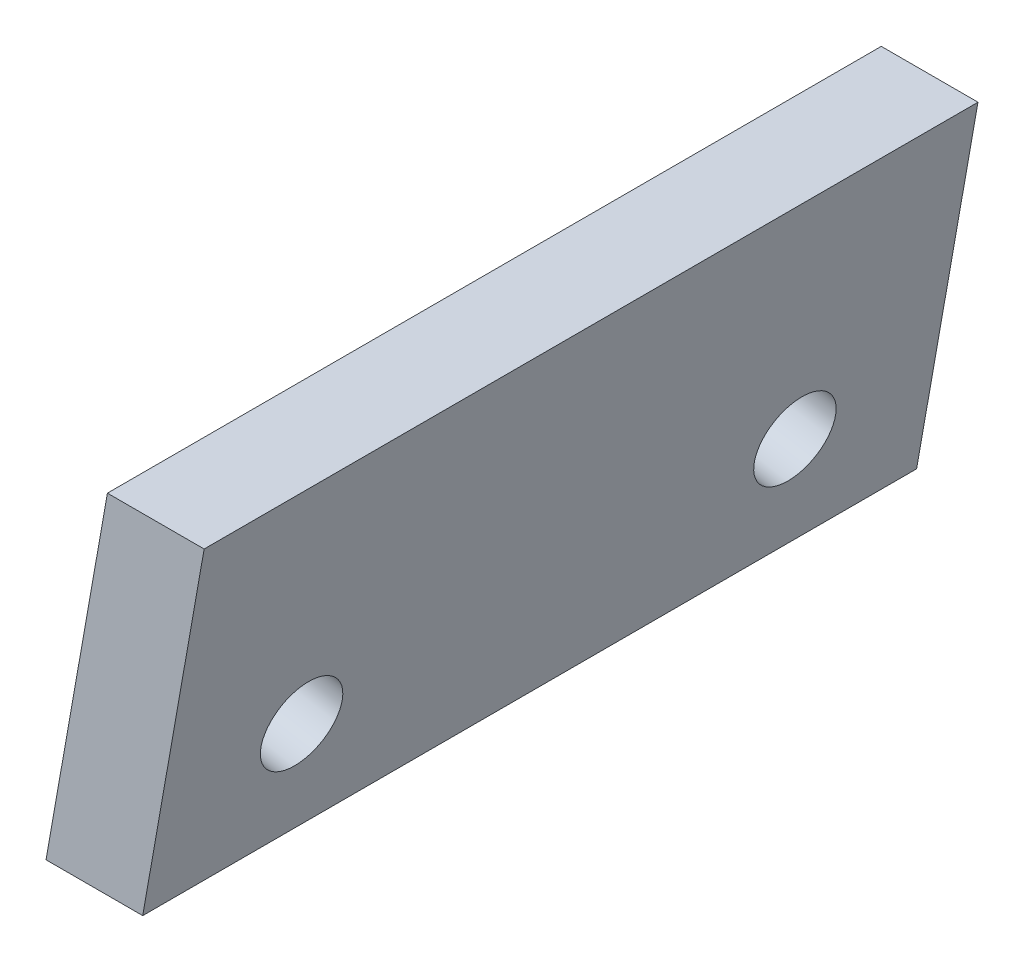
ISO-10303-21;
HEADER;
FILE_DESCRIPTION(('STEP AP214'),'2;1');
FILE_NAME('part.step','',(''),(''),'','','');
FILE_SCHEMA(('AUTOMOTIVE_DESIGN { 1 0 10303 214 1 1 1 1 }'));
ENDSEC;
DATA;
#1=APPLICATION_CONTEXT('core data for automotive mechanical design processes');
#2=APPLICATION_PROTOCOL_DEFINITION('international standard','automotive_design',2000,#1);
#3=PRODUCT_CONTEXT('',#1,'mechanical');
#4=PRODUCT('Part','Part','',(#3));
#5=PRODUCT_RELATED_PRODUCT_CATEGORY('part','',(#4));
#6=PRODUCT_DEFINITION_FORMATION('','',#4);
#7=PRODUCT_DEFINITION_CONTEXT('part definition',#1,'design');
#8=PRODUCT_DEFINITION('design','',#6,#7);
#9=PRODUCT_DEFINITION_SHAPE('','',#8);
#10=(LENGTH_UNIT() NAMED_UNIT(*) SI_UNIT(.MILLI.,.METRE.));
#11=(NAMED_UNIT(*) PLANE_ANGLE_UNIT() SI_UNIT($,.RADIAN.));
#12=(NAMED_UNIT(*) SI_UNIT($,.STERADIAN.) SOLID_ANGLE_UNIT());
#13=UNCERTAINTY_MEASURE_WITH_UNIT(LENGTH_MEASURE(1.E-05),#10,'distance_accuracy_value','');
#14=(GEOMETRIC_REPRESENTATION_CONTEXT(3) GLOBAL_UNCERTAINTY_ASSIGNED_CONTEXT((#13)) GLOBAL_UNIT_ASSIGNED_CONTEXT((#10,
#11,#12)) REPRESENTATION_CONTEXT('',''));
#15=CARTESIAN_POINT('',(0.,0.,0.));
#16=DIRECTION('',(0.,0.,1.));
#17=DIRECTION('',(1.,0.,0.));
#18=AXIS2_PLACEMENT_3D('',#15,#16,#17);
#19=CARTESIAN_POINT('',(0.,0.,20.));
#20=DIRECTION('',(0.984807753012209,-0.173648177666927,0.));
#21=DIRECTION('',(0.173648177666927,0.984807753012209,0.));
#22=AXIS2_PLACEMENT_3D('',#19,#20,#21);
#23=PLANE('',#22);
#24=CARTESIAN_POINT('',(0.555674168534167,3.15138480963907,3.625));
#25=DIRECTION('',(-0.984807753012209,0.173648177666927,0.));
#26=DIRECTION('',(-0.173648177666927,-0.984807753012209,0.));
#27=AXIS2_PLACEMENT_3D('',#24,#25,#26);
#28=CIRCLE('',#27,1.05);
#29=CARTESIAN_POINT('',(0.373343581983894,2.11733666897625,3.625));
#30=VERTEX_POINT('',#29);
#31=EDGE_CURVE('E108',#30,#30,#28,.T.);
#32=ORIENTED_EDGE('',*,*,#31,.F.);
#33=EDGE_LOOP('',(#32));
#34=FACE_BOUND('',#33,.T.);
#35=CARTESIAN_POINT('',(0.555674168534167,3.15138480963907,16.375));
#36=DIRECTION('',(-0.984807753012209,0.173648177666927,0.));
#37=DIRECTION('',(-0.173648177666927,-0.984807753012209,0.));
#38=AXIS2_PLACEMENT_3D('',#35,#36,#37);
#39=CIRCLE('',#38,1.05);
#40=CARTESIAN_POINT('',(0.373343581983894,2.11733666897625,16.375));
#41=VERTEX_POINT('',#40);
#42=EDGE_CURVE('E113',#41,#41,#39,.T.);
#43=ORIENTED_EDGE('',*,*,#42,.F.);
#44=EDGE_LOOP('',(#43));
#45=FACE_BOUND('',#44,.T.);
#46=DIRECTION('',(-0.173648177666927,-0.984807753012209,0.));
#47=VECTOR('',#46,1.);
#48=CARTESIAN_POINT('',(0.,0.,0.));
#49=LINE('',#48,#47);
#50=CARTESIAN_POINT('',(1.58694282637616,9.,0.));
#51=VERTEX_POINT('',#50);
#52=CARTESIAN_POINT('',(0.,0.,0.));
#53=VERTEX_POINT('',#52);
#54=EDGE_CURVE('E99',#51,#53,#49,.T.);
#55=ORIENTED_EDGE('',*,*,#54,.T.);
#56=DIRECTION('',(0.,0.,-1.));
#57=VECTOR('',#56,1.);
#58=CARTESIAN_POINT('',(0.,0.,20.));
#59=LINE('',#58,#57);
#60=CARTESIAN_POINT('',(0.,0.,20.));
#61=VERTEX_POINT('',#60);
#62=EDGE_CURVE('E11',#61,#53,#59,.T.);
#63=ORIENTED_EDGE('',*,*,#62,.F.);
#64=DIRECTION('',(-0.173648177666927,-0.984807753012209,0.));
#65=VECTOR('',#64,1.);
#66=CARTESIAN_POINT('',(0.,0.,20.));
#67=LINE('',#66,#65);
#68=CARTESIAN_POINT('',(1.58694282637616,9.,20.));
#69=VERTEX_POINT('',#68);
#70=EDGE_CURVE('E86',#69,#61,#67,.T.);
#71=ORIENTED_EDGE('',*,*,#70,.F.);
#72=DIRECTION('',(0.,0.,-1.));
#73=VECTOR('',#72,1.);
#74=CARTESIAN_POINT('',(1.58694282637616,9.,20.));
#75=LINE('',#74,#73);
#76=EDGE_CURVE('E95',#69,#51,#75,.T.);
#77=ORIENTED_EDGE('',*,*,#76,.T.);
#78=EDGE_LOOP('',(#55,#63,#71,#77));
#79=FACE_BOUND('',#78,.T.);
#80=ADVANCED_FACE('F33',(#34,#45,#79),#23,.F.);
#81=CARTESIAN_POINT('',(0.,0.,20.));
#82=DIRECTION('',(0.,1.,0.));
#83=DIRECTION('',(0.,0.,1.));
#84=AXIS2_PLACEMENT_3D('',#81,#82,#83);
#85=PLANE('',#84);
#86=DIRECTION('',(1.,0.,0.));
#87=VECTOR('',#86,1.);
#88=CARTESIAN_POINT('',(0.,0.,0.));
#89=LINE('',#88,#87);
#90=CARTESIAN_POINT('',(2.5,0.,0.));
#91=VERTEX_POINT('',#90);
#92=EDGE_CURVE('E90',#53,#91,#89,.T.);
#93=ORIENTED_EDGE('',*,*,#92,.T.);
#94=DIRECTION('',(0.,0.,-1.));
#95=VECTOR('',#94,1.);
#96=CARTESIAN_POINT('',(2.5,0.,20.));
#97=LINE('',#96,#95);
#98=CARTESIAN_POINT('',(2.5,0.,20.));
#99=VERTEX_POINT('',#98);
#100=EDGE_CURVE('E42',#99,#91,#97,.T.);
#101=ORIENTED_EDGE('',*,*,#100,.F.);
#102=DIRECTION('',(1.,0.,0.));
#103=VECTOR('',#102,1.);
#104=CARTESIAN_POINT('',(0.,0.,20.));
#105=LINE('',#104,#103);
#106=EDGE_CURVE('E81',#61,#99,#105,.T.);
#107=ORIENTED_EDGE('',*,*,#106,.F.);
#108=ORIENTED_EDGE('',*,*,#62,.T.);
#109=EDGE_LOOP('',(#93,#101,#107,#108));
#110=FACE_BOUND('',#109,.T.);
#111=ADVANCED_FACE('F89',(#110),#85,.F.);
#112=CARTESIAN_POINT('',(2.5,0.,20.));
#113=DIRECTION('',(-0.984807753012208,0.173648177666927,0.));
#114=DIRECTION('',(-0.173648177666927,-0.984807753012209,0.));
#115=AXIS2_PLACEMENT_3D('',#112,#113,#114);
#116=PLANE('',#115);
#117=CARTESIAN_POINT('',(2.98028994451655,2.72385963048199,3.625));
#118=DIRECTION('',(-0.984807753012208,0.173648177666927,0.));
#119=DIRECTION('',(-0.173648177666927,-0.984807753012209,0.));
#120=AXIS2_PLACEMENT_3D('',#117,#118,#119);
#121=CIRCLE('',#120,1.05);
#122=CARTESIAN_POINT('',(2.79795935796628,1.68981148981917,3.625));
#123=VERTEX_POINT('',#122);
#124=EDGE_CURVE('E36',#123,#123,#121,.T.);
#125=ORIENTED_EDGE('',*,*,#124,.T.);
#126=EDGE_LOOP('',(#125));
#127=FACE_BOUND('',#126,.T.);
#128=CARTESIAN_POINT('',(2.98028994451655,2.72385963048199,16.375));
#129=DIRECTION('',(-0.984807753012208,0.173648177666927,0.));
#130=DIRECTION('',(-0.173648177666927,-0.984807753012209,0.));
#131=AXIS2_PLACEMENT_3D('',#128,#129,#130);
#132=CIRCLE('',#131,1.05);
#133=CARTESIAN_POINT('',(2.79795935796628,1.68981148981917,16.375));
#134=VERTEX_POINT('',#133);
#135=EDGE_CURVE('E106',#134,#134,#132,.T.);
#136=ORIENTED_EDGE('',*,*,#135,.T.);
#137=EDGE_LOOP('',(#136));
#138=FACE_BOUND('',#137,.T.);
#139=DIRECTION('',(0.173648177666927,0.984807753012209,0.));
#140=VECTOR('',#139,1.);
#141=CARTESIAN_POINT('',(2.5,0.,0.));
#142=LINE('',#141,#140);
#143=CARTESIAN_POINT('',(4.08694282637616,9.,0.));
#144=VERTEX_POINT('',#143);
#145=EDGE_CURVE('E68',#91,#144,#142,.T.);
#146=ORIENTED_EDGE('',*,*,#145,.T.);
#147=DIRECTION('',(0.,0.,-1.));
#148=VECTOR('',#147,1.);
#149=CARTESIAN_POINT('',(4.08694282637616,9.,20.));
#150=LINE('',#149,#148);
#151=CARTESIAN_POINT('',(4.08694282637616,9.,20.));
#152=VERTEX_POINT('',#151);
#153=EDGE_CURVE('E91',#152,#144,#150,.T.);
#154=ORIENTED_EDGE('',*,*,#153,.F.);
#155=DIRECTION('',(0.173648177666927,0.984807753012209,0.));
#156=VECTOR('',#155,1.);
#157=CARTESIAN_POINT('',(2.5,0.,20.));
#158=LINE('',#157,#156);
#159=EDGE_CURVE('E84',#99,#152,#158,.T.);
#160=ORIENTED_EDGE('',*,*,#159,.F.);
#161=ORIENTED_EDGE('',*,*,#100,.T.);
#162=EDGE_LOOP('',(#146,#154,#160,#161));
#163=FACE_BOUND('',#162,.T.);
#164=ADVANCED_FACE('F93',(#127,#138,#163),#116,.F.);
#165=CARTESIAN_POINT('',(4.08694282637616,9.,20.));
#166=DIRECTION('',(0.,-1.,0.));
#167=DIRECTION('',(1.,0.,0.));
#168=AXIS2_PLACEMENT_3D('',#165,#166,#167);
#169=PLANE('',#168);
#170=DIRECTION('',(-1.,0.,0.));
#171=VECTOR('',#170,1.);
#172=CARTESIAN_POINT('',(4.08694282637616,9.,0.));
#173=LINE('',#172,#171);
#174=EDGE_CURVE('E74',#144,#51,#173,.T.);
#175=ORIENTED_EDGE('',*,*,#174,.T.);
#176=ORIENTED_EDGE('',*,*,#76,.F.);
#177=DIRECTION('',(-1.,0.,0.));
#178=VECTOR('',#177,1.);
#179=CARTESIAN_POINT('',(4.08694282637616,9.,20.));
#180=LINE('',#179,#178);
#181=EDGE_CURVE('E51',#152,#69,#180,.T.);
#182=ORIENTED_EDGE('',*,*,#181,.F.);
#183=ORIENTED_EDGE('',*,*,#153,.T.);
#184=EDGE_LOOP('',(#175,#176,#182,#183));
#185=FACE_BOUND('',#184,.T.);
#186=ADVANCED_FACE('F138',(#185),#169,.F.);
#187=CARTESIAN_POINT('',(0.,0.,20.));
#188=DIRECTION('',(0.,0.,1.));
#189=DIRECTION('',(1.,0.,0.));
#190=AXIS2_PLACEMENT_3D('',#187,#188,#189);
#191=PLANE('',#190);
#192=ORIENTED_EDGE('',*,*,#70,.T.);
#193=ORIENTED_EDGE('',*,*,#106,.T.);
#194=ORIENTED_EDGE('',*,*,#159,.T.);
#195=ORIENTED_EDGE('',*,*,#181,.T.);
#196=EDGE_LOOP('',(#192,#193,#194,#195));
#197=FACE_BOUND('',#196,.T.);
#198=ADVANCED_FACE('F82',(#197),#191,.T.);
#199=CARTESIAN_POINT('',(0.,0.,0.));
#200=DIRECTION('',(0.,0.,1.));
#201=DIRECTION('',(1.,0.,0.));
#202=AXIS2_PLACEMENT_3D('',#199,#200,#201);
#203=PLANE('',#202);
#204=ORIENTED_EDGE('',*,*,#54,.F.);
#205=ORIENTED_EDGE('',*,*,#174,.F.);
#206=ORIENTED_EDGE('',*,*,#145,.F.);
#207=ORIENTED_EDGE('',*,*,#92,.F.);
#208=EDGE_LOOP('',(#204,#205,#206,#207));
#209=FACE_BOUND('',#208,.T.);
#210=ADVANCED_FACE('F129',(#209),#203,.F.);
#211=CARTESIAN_POINT('',(4.51938058948204,2.45247642401859,16.375));
#212=DIRECTION('',(-0.984807753012209,0.173648177666927,0.));
#213=DIRECTION('',(-0.173648177666927,-0.984807753012209,0.));
#214=AXIS2_PLACEMENT_3D('',#211,#212,#213);
#215=CYLINDRICAL_SURFACE('',#214,1.05);
#216=ORIENTED_EDGE('',*,*,#42,.T.);
#217=EDGE_LOOP('',(#216));
#218=FACE_BOUND('',#217,.T.);
#219=ORIENTED_EDGE('',*,*,#135,.F.);
#220=EDGE_LOOP('',(#219));
#221=FACE_BOUND('',#220,.T.);
#222=ADVANCED_FACE('F121',(#218,#221),#215,.F.);
#223=CARTESIAN_POINT('',(4.51938058948204,2.45247642401859,3.625));
#224=DIRECTION('',(-0.984807753012209,0.173648177666927,0.));
#225=DIRECTION('',(-0.173648177666927,-0.984807753012209,0.));
#226=AXIS2_PLACEMENT_3D('',#223,#224,#225);
#227=CYLINDRICAL_SURFACE('',#226,1.05);
#228=ORIENTED_EDGE('',*,*,#31,.T.);
#229=EDGE_LOOP('',(#228));
#230=FACE_BOUND('',#229,.T.);
#231=ORIENTED_EDGE('',*,*,#124,.F.);
#232=EDGE_LOOP('',(#231));
#233=FACE_BOUND('',#232,.T.);
#234=ADVANCED_FACE('F136',(#230,#233),#227,.F.);
#235=CLOSED_SHELL('',(#80,#111,#164,#186,#198,#210,#222,#234));
#236=MANIFOLD_SOLID_BREP('B2',#235);
#237=ADVANCED_BREP_SHAPE_REPRESENTATION('',(#18,#236),#14);
#238=SHAPE_DEFINITION_REPRESENTATION(#9,#237);
ENDSEC;
END-ISO-10303-21;
